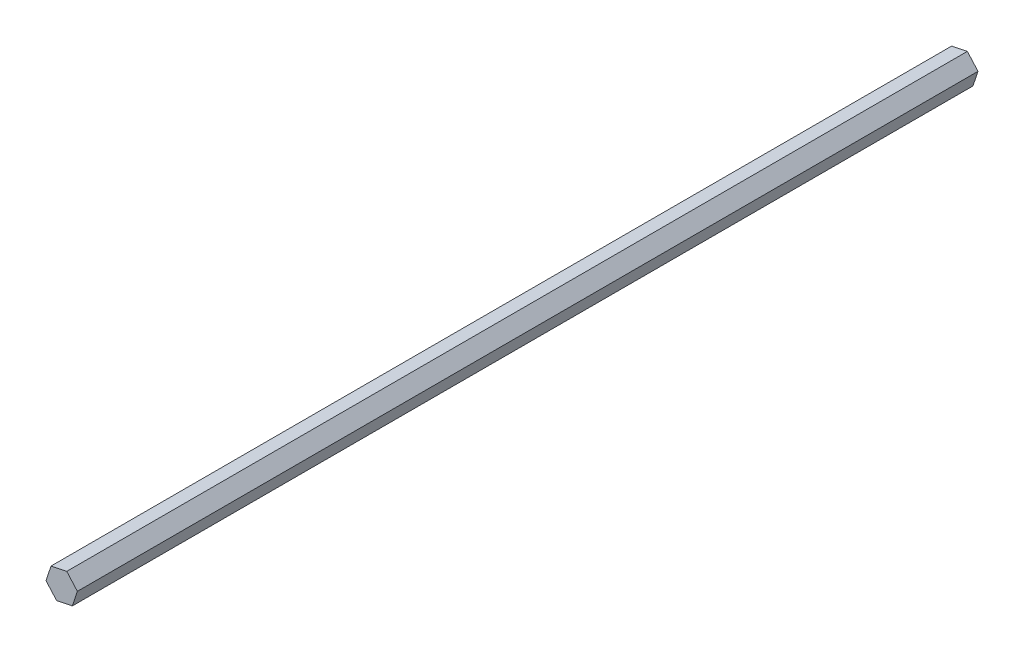
ISO-10303-21;
HEADER;
FILE_DESCRIPTION(('STEP AP214'),'2;1');
FILE_NAME('part.step','',(''),(''),'','','');
FILE_SCHEMA(('AUTOMOTIVE_DESIGN { 1 0 10303 214 1 1 1 1 }'));
ENDSEC;
DATA;
#1=APPLICATION_CONTEXT('core data for automotive mechanical design processes');
#2=APPLICATION_PROTOCOL_DEFINITION('international standard','automotive_design',2000,#1);
#3=PRODUCT_CONTEXT('',#1,'mechanical');
#4=PRODUCT('Part','Part','',(#3));
#5=PRODUCT_RELATED_PRODUCT_CATEGORY('part','',(#4));
#6=PRODUCT_DEFINITION_FORMATION('','',#4);
#7=PRODUCT_DEFINITION_CONTEXT('part definition',#1,'design');
#8=PRODUCT_DEFINITION('design','',#6,#7);
#9=PRODUCT_DEFINITION_SHAPE('','',#8);
#10=(LENGTH_UNIT() NAMED_UNIT(*) SI_UNIT(.MILLI.,.METRE.));
#11=(NAMED_UNIT(*) PLANE_ANGLE_UNIT() SI_UNIT($,.RADIAN.));
#12=(NAMED_UNIT(*) SI_UNIT($,.STERADIAN.) SOLID_ANGLE_UNIT());
#13=UNCERTAINTY_MEASURE_WITH_UNIT(LENGTH_MEASURE(1.E-05),#10,'distance_accuracy_value','');
#14=(GEOMETRIC_REPRESENTATION_CONTEXT(3) GLOBAL_UNCERTAINTY_ASSIGNED_CONTEXT((#13)) GLOBAL_UNIT_ASSIGNED_CONTEXT((#10,
#11,#12)) REPRESENTATION_CONTEXT('',''));
#15=CARTESIAN_POINT('',(0.,0.,0.));
#16=DIRECTION('',(0.,0.,1.));
#17=DIRECTION('',(1.,0.,0.));
#18=AXIS2_PLACEMENT_3D('',#15,#16,#17);
#19=CARTESIAN_POINT('',(-2.31037560209544,-6.95884314455898,412.242));
#20=DIRECTION('',(-0.201651302440639,0.979457376420227,0.));
#21=DIRECTION('',(-0.979457376420227,-0.201651302440639,0.));
#22=AXIS2_PLACEMENT_3D('',#19,#20,#21);
#23=PLANE('',#22);
#24=DIRECTION('',(0.979457376420227,0.201651302440639,0.));
#25=VECTOR('',#24,1.);
#26=CARTESIAN_POINT('',(-2.31037560209544,-6.95884314455898,0.));
#27=LINE('',#26,#25);
#28=CARTESIAN_POINT('',(-2.31037560209544,-6.95884314455898,0.));
#29=VERTEX_POINT('',#28);
#30=CARTESIAN_POINT('',(4.87134714309154,-5.4802655359779,0.));
#31=VERTEX_POINT('',#30);
#32=EDGE_CURVE('E118',#29,#31,#27,.T.);
#33=ORIENTED_EDGE('',*,*,#32,.T.);
#34=DIRECTION('',(0.,0.,-1.));
#35=VECTOR('',#34,1.);
#36=CARTESIAN_POINT('',(4.87134714309154,-5.4802655359779,412.242));
#37=LINE('',#36,#35);
#38=CARTESIAN_POINT('',(4.87134714309154,-5.4802655359779,412.242));
#39=VERTEX_POINT('',#38);
#40=EDGE_CURVE('E11',#39,#31,#37,.T.);
#41=ORIENTED_EDGE('',*,*,#40,.F.);
#42=DIRECTION('',(0.979457376420227,0.201651302440639,0.));
#43=VECTOR('',#42,1.);
#44=CARTESIAN_POINT('',(-2.31037560209544,-6.95884314455898,412.242));
#45=LINE('',#44,#43);
#46=CARTESIAN_POINT('',(-2.31037560209544,-6.95884314455898,412.242));
#47=VERTEX_POINT('',#46);
#48=EDGE_CURVE('E128',#47,#39,#45,.T.);
#49=ORIENTED_EDGE('',*,*,#48,.F.);
#50=DIRECTION('',(0.,0.,-1.));
#51=VECTOR('',#50,1.);
#52=CARTESIAN_POINT('',(-2.31037560209544,-6.95884314455898,412.242));
#53=LINE('',#52,#51);
#54=EDGE_CURVE('E114',#47,#29,#53,.T.);
#55=ORIENTED_EDGE('',*,*,#54,.T.);
#56=EDGE_LOOP('',(#33,#41,#49,#55));
#57=FACE_BOUND('',#56,.T.);
#58=ADVANCED_FACE('F34',(#57),#23,.F.);
#59=CARTESIAN_POINT('',(4.87134714309154,-5.4802655359779,412.242));
#60=DIRECTION('',(-0.949060621124294,0.315093537590301,0.));
#61=DIRECTION('',(-0.315093537590301,-0.949060621124294,0.));
#62=AXIS2_PLACEMENT_3D('',#59,#60,#61);
#63=PLANE('',#62);
#64=DIRECTION('',(0.315093537590301,0.949060621124293,0.));
#65=VECTOR('',#64,1.);
#66=CARTESIAN_POINT('',(4.87134714309154,-5.4802655359779,0.));
#67=LINE('',#66,#65);
#68=CARTESIAN_POINT('',(7.18172274518697,1.47857760858108,0.));
#69=VERTEX_POINT('',#68);
#70=EDGE_CURVE('E121',#31,#69,#67,.T.);
#71=ORIENTED_EDGE('',*,*,#70,.T.);
#72=DIRECTION('',(0.,0.,-1.));
#73=VECTOR('',#72,1.);
#74=CARTESIAN_POINT('',(7.18172274518697,1.47857760858108,412.242));
#75=LINE('',#74,#73);
#76=CARTESIAN_POINT('',(7.18172274518697,1.47857760858108,412.242));
#77=VERTEX_POINT('',#76);
#78=EDGE_CURVE('E42',#77,#69,#75,.T.);
#79=ORIENTED_EDGE('',*,*,#78,.F.);
#80=DIRECTION('',(0.315093537590301,0.949060621124293,0.));
#81=VECTOR('',#80,1.);
#82=CARTESIAN_POINT('',(4.87134714309154,-5.4802655359779,412.242));
#83=LINE('',#82,#81);
#84=EDGE_CURVE('E87',#39,#77,#83,.T.);
#85=ORIENTED_EDGE('',*,*,#84,.F.);
#86=ORIENTED_EDGE('',*,*,#40,.T.);
#87=EDGE_LOOP('',(#71,#79,#85,#86));
#88=FACE_BOUND('',#87,.T.);
#89=ADVANCED_FACE('F152',(#88),#63,.F.);
#90=CARTESIAN_POINT('',(7.18172274518697,1.47857760858108,412.242));
#91=DIRECTION('',(-0.747409318683654,-0.664363838829926,0.));
#92=DIRECTION('',(0.664363838829926,-0.747409318683654,0.));
#93=AXIS2_PLACEMENT_3D('',#90,#91,#92);
#94=PLANE('',#93);
#95=DIRECTION('',(-0.664363838829926,0.747409318683654,0.));
#96=VECTOR('',#95,1.);
#97=CARTESIAN_POINT('',(7.18172274518697,1.47857760858108,0.));
#98=LINE('',#97,#96);
#99=CARTESIAN_POINT('',(2.31037560209543,6.95884314455898,0.));
#100=VERTEX_POINT('',#99);
#101=EDGE_CURVE('E123',#69,#100,#98,.T.);
#102=ORIENTED_EDGE('',*,*,#101,.T.);
#103=DIRECTION('',(0.,0.,-1.));
#104=VECTOR('',#103,1.);
#105=CARTESIAN_POINT('',(2.31037560209543,6.95884314455898,412.242));
#106=LINE('',#105,#104);
#107=CARTESIAN_POINT('',(2.31037560209543,6.95884314455898,412.242));
#108=VERTEX_POINT('',#107);
#109=EDGE_CURVE('E109',#108,#100,#106,.T.);
#110=ORIENTED_EDGE('',*,*,#109,.F.);
#111=DIRECTION('',(-0.664363838829926,0.747409318683654,0.));
#112=VECTOR('',#111,1.);
#113=CARTESIAN_POINT('',(7.18172274518697,1.47857760858108,412.242));
#114=LINE('',#113,#112);
#115=EDGE_CURVE('E100',#77,#108,#114,.T.);
#116=ORIENTED_EDGE('',*,*,#115,.F.);
#117=ORIENTED_EDGE('',*,*,#78,.T.);
#118=EDGE_LOOP('',(#102,#110,#116,#117));
#119=FACE_BOUND('',#118,.T.);
#120=ADVANCED_FACE('F134',(#119),#94,.F.);
#121=CARTESIAN_POINT('',(2.31037560209543,6.95884314455898,412.242));
#122=DIRECTION('',(0.201651302440639,-0.979457376420227,0.));
#123=DIRECTION('',(0.979457376420227,0.201651302440639,0.));
#124=AXIS2_PLACEMENT_3D('',#121,#122,#123);
#125=PLANE('',#124);
#126=DIRECTION('',(-0.979457376420227,-0.201651302440639,0.));
#127=VECTOR('',#126,1.);
#128=CARTESIAN_POINT('',(2.31037560209543,6.95884314455898,0.));
#129=LINE('',#128,#127);
#130=CARTESIAN_POINT('',(-4.87134714309155,5.4802655359779,0.));
#131=VERTEX_POINT('',#130);
#132=EDGE_CURVE('E108',#100,#131,#129,.T.);
#133=ORIENTED_EDGE('',*,*,#132,.T.);
#134=DIRECTION('',(0.,0.,-1.));
#135=VECTOR('',#134,1.);
#136=CARTESIAN_POINT('',(-4.87134714309155,5.4802655359779,412.242));
#137=LINE('',#136,#135);
#138=CARTESIAN_POINT('',(-4.87134714309155,5.4802655359779,412.242));
#139=VERTEX_POINT('',#138);
#140=EDGE_CURVE('E105',#139,#131,#137,.T.);
#141=ORIENTED_EDGE('',*,*,#140,.F.);
#142=DIRECTION('',(-0.979457376420227,-0.201651302440639,0.));
#143=VECTOR('',#142,1.);
#144=CARTESIAN_POINT('',(2.31037560209543,6.95884314455898,412.242));
#145=LINE('',#144,#143);
#146=EDGE_CURVE('E94',#108,#139,#145,.T.);
#147=ORIENTED_EDGE('',*,*,#146,.F.);
#148=ORIENTED_EDGE('',*,*,#109,.T.);
#149=EDGE_LOOP('',(#133,#141,#147,#148));
#150=FACE_BOUND('',#149,.T.);
#151=ADVANCED_FACE('F106',(#150),#125,.F.);
#152=CARTESIAN_POINT('',(-4.87134714309155,5.4802655359779,412.242));
#153=DIRECTION('',(0.949060621124294,-0.315093537590301,0.));
#154=DIRECTION('',(0.315093537590301,0.949060621124294,0.));
#155=AXIS2_PLACEMENT_3D('',#152,#153,#154);
#156=PLANE('',#155);
#157=DIRECTION('',(-0.315093537590301,-0.949060621124293,0.));
#158=VECTOR('',#157,1.);
#159=CARTESIAN_POINT('',(-4.87134714309155,5.4802655359779,0.));
#160=LINE('',#159,#158);
#161=CARTESIAN_POINT('',(-7.18172274518698,-1.47857760858108,0.));
#162=VERTEX_POINT('',#161);
#163=EDGE_CURVE('E73',#131,#162,#160,.T.);
#164=ORIENTED_EDGE('',*,*,#163,.T.);
#165=DIRECTION('',(0.,0.,-1.));
#166=VECTOR('',#165,1.);
#167=CARTESIAN_POINT('',(-7.18172274518698,-1.47857760858108,412.242));
#168=LINE('',#167,#166);
#169=CARTESIAN_POINT('',(-7.18172274518698,-1.47857760858108,412.242));
#170=VERTEX_POINT('',#169);
#171=EDGE_CURVE('E110',#170,#162,#168,.T.);
#172=ORIENTED_EDGE('',*,*,#171,.F.);
#173=DIRECTION('',(-0.315093537590301,-0.949060621124293,0.));
#174=VECTOR('',#173,1.);
#175=CARTESIAN_POINT('',(-4.87134714309155,5.4802655359779,412.242));
#176=LINE('',#175,#174);
#177=EDGE_CURVE('E98',#139,#170,#176,.T.);
#178=ORIENTED_EDGE('',*,*,#177,.F.);
#179=ORIENTED_EDGE('',*,*,#140,.T.);
#180=EDGE_LOOP('',(#164,#172,#178,#179));
#181=FACE_BOUND('',#180,.T.);
#182=ADVANCED_FACE('F112',(#181),#156,.F.);
#183=CARTESIAN_POINT('',(-7.18172274518698,-1.47857760858108,412.242));
#184=DIRECTION('',(0.747409318683654,0.664363838829926,0.));
#185=DIRECTION('',(-0.664363838829926,0.747409318683654,0.));
#186=AXIS2_PLACEMENT_3D('',#183,#184,#185);
#187=PLANE('',#186);
#188=DIRECTION('',(0.664363838829926,-0.747409318683654,0.));
#189=VECTOR('',#188,1.);
#190=CARTESIAN_POINT('',(-7.18172274518698,-1.47857760858108,0.));
#191=LINE('',#190,#189);
#192=EDGE_CURVE('E79',#162,#29,#191,.T.);
#193=ORIENTED_EDGE('',*,*,#192,.T.);
#194=ORIENTED_EDGE('',*,*,#54,.F.);
#195=DIRECTION('',(0.664363838829926,-0.747409318683654,0.));
#196=VECTOR('',#195,1.);
#197=CARTESIAN_POINT('',(-7.18172274518698,-1.47857760858108,412.242));
#198=LINE('',#197,#196);
#199=EDGE_CURVE('E50',#170,#47,#198,.T.);
#200=ORIENTED_EDGE('',*,*,#199,.F.);
#201=ORIENTED_EDGE('',*,*,#171,.T.);
#202=EDGE_LOOP('',(#193,#194,#200,#201));
#203=FACE_BOUND('',#202,.T.);
#204=ADVANCED_FACE('F141',(#203),#187,.F.);
#205=CARTESIAN_POINT('',(0.,0.,412.242));
#206=DIRECTION('',(0.,0.,1.));
#207=DIRECTION('',(1.,0.,0.));
#208=AXIS2_PLACEMENT_3D('',#205,#206,#207);
#209=PLANE('',#208);
#210=ORIENTED_EDGE('',*,*,#48,.T.);
#211=ORIENTED_EDGE('',*,*,#84,.T.);
#212=ORIENTED_EDGE('',*,*,#115,.T.);
#213=ORIENTED_EDGE('',*,*,#146,.T.);
#214=ORIENTED_EDGE('',*,*,#177,.T.);
#215=ORIENTED_EDGE('',*,*,#199,.T.);
#216=EDGE_LOOP('',(#210,#211,#212,#213,#214,#215));
#217=FACE_BOUND('',#216,.T.);
#218=ADVANCED_FACE('F96',(#217),#209,.T.);
#219=CARTESIAN_POINT('',(0.,0.,0.));
#220=DIRECTION('',(0.,0.,1.));
#221=DIRECTION('',(1.,0.,0.));
#222=AXIS2_PLACEMENT_3D('',#219,#220,#221);
#223=PLANE('',#222);
#224=ORIENTED_EDGE('',*,*,#32,.F.);
#225=ORIENTED_EDGE('',*,*,#192,.F.);
#226=ORIENTED_EDGE('',*,*,#163,.F.);
#227=ORIENTED_EDGE('',*,*,#132,.F.);
#228=ORIENTED_EDGE('',*,*,#101,.F.);
#229=ORIENTED_EDGE('',*,*,#70,.F.);
#230=EDGE_LOOP('',(#224,#225,#226,#227,#228,#229));
#231=FACE_BOUND('',#230,.T.);
#232=ADVANCED_FACE('F137',(#231),#223,.F.);
#233=CLOSED_SHELL('',(#58,#89,#120,#151,#182,#204,#218,#232));
#234=MANIFOLD_SOLID_BREP('B2',#233);
#235=ADVANCED_BREP_SHAPE_REPRESENTATION('',(#18,#234),#14);
#236=SHAPE_DEFINITION_REPRESENTATION(#9,#235);
ENDSEC;
END-ISO-10303-21;
